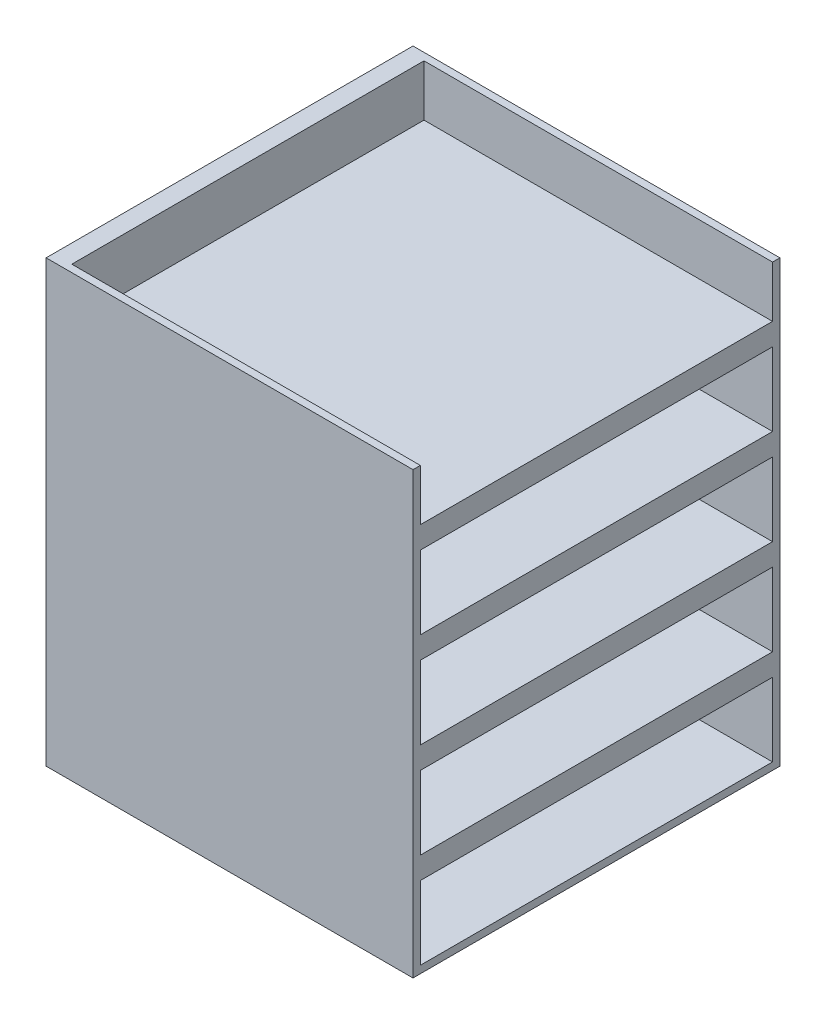
ISO-10303-21;
HEADER;
FILE_DESCRIPTION(('STEP AP214'),'2;1');
FILE_NAME('part.step','',(''),(''),'','','');
FILE_SCHEMA(('AUTOMOTIVE_DESIGN { 1 0 10303 214 1 1 1 1 }'));
ENDSEC;
DATA;
#1=APPLICATION_CONTEXT('core data for automotive mechanical design processes');
#2=APPLICATION_PROTOCOL_DEFINITION('international standard','automotive_design',2000,#1);
#3=PRODUCT_CONTEXT('',#1,'mechanical');
#4=PRODUCT('Part','Part','',(#3));
#5=PRODUCT_RELATED_PRODUCT_CATEGORY('part','',(#4));
#6=PRODUCT_DEFINITION_FORMATION('','',#4);
#7=PRODUCT_DEFINITION_CONTEXT('part definition',#1,'design');
#8=PRODUCT_DEFINITION('design','',#6,#7);
#9=PRODUCT_DEFINITION_SHAPE('','',#8);
#10=(LENGTH_UNIT() NAMED_UNIT(*) SI_UNIT(.MILLI.,.METRE.));
#11=(NAMED_UNIT(*) PLANE_ANGLE_UNIT() SI_UNIT($,.RADIAN.));
#12=(NAMED_UNIT(*) SI_UNIT($,.STERADIAN.) SOLID_ANGLE_UNIT());
#13=UNCERTAINTY_MEASURE_WITH_UNIT(LENGTH_MEASURE(1.E-05),#10,'distance_accuracy_value','');
#14=(GEOMETRIC_REPRESENTATION_CONTEXT(3) GLOBAL_UNCERTAINTY_ASSIGNED_CONTEXT((#13)) GLOBAL_UNIT_ASSIGNED_CONTEXT((#10,
#11,#12)) REPRESENTATION_CONTEXT('',''));
#15=CARTESIAN_POINT('',(0.,0.,0.));
#16=DIRECTION('',(0.,0.,1.));
#17=DIRECTION('',(1.,0.,0.));
#18=AXIS2_PLACEMENT_3D('',#15,#16,#17);
#19=CARTESIAN_POINT('',(250.,600.,-250.));
#20=DIRECTION('',(-1.,0.,0.));
#21=DIRECTION('',(0.,0.,1.));
#22=AXIS2_PLACEMENT_3D('',#19,#20,#21);
#23=PLANE('',#22);
#24=DIRECTION('',(0.,0.,-1.));
#25=VECTOR('',#24,1.);
#26=CARTESIAN_POINT('',(250.,140.,-239.999999999999));
#27=LINE('',#26,#25);
#28=CARTESIAN_POINT('',(250.,140.,240.));
#29=VERTEX_POINT('',#28);
#30=CARTESIAN_POINT('',(250.,140.,-239.999999999999));
#31=VERTEX_POINT('',#30);
#32=EDGE_CURVE('E223',#29,#31,#27,.T.);
#33=ORIENTED_EDGE('',*,*,#32,.F.);
#34=DIRECTION('',(0.,-1.,0.));
#35=VECTOR('',#34,1.);
#36=CARTESIAN_POINT('',(250.,240.,240.));
#37=LINE('',#36,#35);
#38=CARTESIAN_POINT('',(250.,240.,240.));
#39=VERTEX_POINT('',#38);
#40=EDGE_CURVE('E49',#39,#29,#37,.T.);
#41=ORIENTED_EDGE('',*,*,#40,.F.);
#42=DIRECTION('',(0.,0.,1.));
#43=VECTOR('',#42,1.);
#44=CARTESIAN_POINT('',(250.,240.,-239.999999999999));
#45=LINE('',#44,#43);
#46=CARTESIAN_POINT('',(250.,240.,-239.999999999999));
#47=VERTEX_POINT('',#46);
#48=EDGE_CURVE('E214',#47,#39,#45,.T.);
#49=ORIENTED_EDGE('',*,*,#48,.F.);
#50=DIRECTION('',(0.,1.,0.));
#51=VECTOR('',#50,1.);
#52=CARTESIAN_POINT('',(250.,240.,-239.999999999999));
#53=LINE('',#52,#51);
#54=EDGE_CURVE('E217',#31,#47,#53,.T.);
#55=ORIENTED_EDGE('',*,*,#54,.F.);
#56=EDGE_LOOP('',(#33,#41,#49,#55));
#57=FACE_BOUND('',#56,.T.);
#58=DIRECTION('',(0.,0.,-1.));
#59=VECTOR('',#58,1.);
#60=CARTESIAN_POINT('',(250.,270.,-239.999999999999));
#61=LINE('',#60,#59);
#62=CARTESIAN_POINT('',(250.,270.,240.000000000001));
#63=VERTEX_POINT('',#62);
#64=CARTESIAN_POINT('',(250.,270.,-239.999999999999));
#65=VERTEX_POINT('',#64);
#66=EDGE_CURVE('E249',#63,#65,#61,.T.);
#67=ORIENTED_EDGE('',*,*,#66,.F.);
#68=DIRECTION('',(0.,-1.,0.));
#69=VECTOR('',#68,1.);
#70=CARTESIAN_POINT('',(250.,370.,240.000000000001));
#71=LINE('',#70,#69);
#72=CARTESIAN_POINT('',(250.,370.,240.000000000001));
#73=VERTEX_POINT('',#72);
#74=EDGE_CURVE('E57',#73,#63,#71,.T.);
#75=ORIENTED_EDGE('',*,*,#74,.F.);
#76=DIRECTION('',(0.,0.,1.));
#77=VECTOR('',#76,1.);
#78=CARTESIAN_POINT('',(250.,370.,-239.999999999999));
#79=LINE('',#78,#77);
#80=CARTESIAN_POINT('',(250.,370.,-239.999999999999));
#81=VERTEX_POINT('',#80);
#82=EDGE_CURVE('E238',#81,#73,#79,.T.);
#83=ORIENTED_EDGE('',*,*,#82,.F.);
#84=DIRECTION('',(0.,1.,0.));
#85=VECTOR('',#84,1.);
#86=CARTESIAN_POINT('',(250.,370.,-239.999999999999));
#87=LINE('',#86,#85);
#88=EDGE_CURVE('E253',#65,#81,#87,.T.);
#89=ORIENTED_EDGE('',*,*,#88,.F.);
#90=EDGE_LOOP('',(#67,#75,#83,#89));
#91=FACE_BOUND('',#90,.T.);
#92=DIRECTION('',(0.,0.,-1.));
#93=VECTOR('',#92,1.);
#94=CARTESIAN_POINT('',(250.,400.,-239.999999999999));
#95=LINE('',#94,#93);
#96=CARTESIAN_POINT('',(250.,400.,240.000000000001));
#97=VERTEX_POINT('',#96);
#98=CARTESIAN_POINT('',(250.,400.,-239.999999999999));
#99=VERTEX_POINT('',#98);
#100=EDGE_CURVE('E280',#97,#99,#95,.T.);
#101=ORIENTED_EDGE('',*,*,#100,.F.);
#102=DIRECTION('',(0.,-1.,0.));
#103=VECTOR('',#102,1.);
#104=CARTESIAN_POINT('',(250.,500.,240.000000000001));
#105=LINE('',#104,#103);
#106=CARTESIAN_POINT('',(250.,500.,240.000000000001));
#107=VERTEX_POINT('',#106);
#108=EDGE_CURVE('E278',#107,#97,#105,.T.);
#109=ORIENTED_EDGE('',*,*,#108,.F.);
#110=DIRECTION('',(0.,0.,1.));
#111=VECTOR('',#110,1.);
#112=CARTESIAN_POINT('',(250.,500.,-239.999999999999));
#113=LINE('',#112,#111);
#114=CARTESIAN_POINT('',(250.,500.,-239.999999999999));
#115=VERTEX_POINT('',#114);
#116=EDGE_CURVE('E268',#115,#107,#113,.T.);
#117=ORIENTED_EDGE('',*,*,#116,.F.);
#118=DIRECTION('',(0.,1.,0.));
#119=VECTOR('',#118,1.);
#120=CARTESIAN_POINT('',(250.,500.,-239.999999999999));
#121=LINE('',#120,#119);
#122=EDGE_CURVE('E284',#99,#115,#121,.T.);
#123=ORIENTED_EDGE('',*,*,#122,.F.);
#124=EDGE_LOOP('',(#101,#109,#117,#123));
#125=FACE_BOUND('',#124,.T.);
#126=DIRECTION('',(0.,0.,-1.));
#127=VECTOR('',#126,1.);
#128=CARTESIAN_POINT('',(250.,10.,-240.));
#129=LINE('',#128,#127);
#130=CARTESIAN_POINT('',(250.,10.,240.));
#131=VERTEX_POINT('',#130);
#132=CARTESIAN_POINT('',(250.,10.,-240.));
#133=VERTEX_POINT('',#132);
#134=EDGE_CURVE('E329',#131,#133,#129,.T.);
#135=ORIENTED_EDGE('',*,*,#134,.F.);
#136=DIRECTION('',(0.,-1.,0.));
#137=VECTOR('',#136,1.);
#138=CARTESIAN_POINT('',(250.,110.,240.));
#139=LINE('',#138,#137);
#140=CARTESIAN_POINT('',(250.,110.,240.));
#141=VERTEX_POINT('',#140);
#142=EDGE_CURVE('E230',#141,#131,#139,.T.);
#143=ORIENTED_EDGE('',*,*,#142,.F.);
#144=DIRECTION('',(0.,0.,1.));
#145=VECTOR('',#144,1.);
#146=CARTESIAN_POINT('',(250.,110.,-240.));
#147=LINE('',#146,#145);
#148=CARTESIAN_POINT('',(250.,110.,-240.));
#149=VERTEX_POINT('',#148);
#150=EDGE_CURVE('E318',#149,#141,#147,.T.);
#151=ORIENTED_EDGE('',*,*,#150,.F.);
#152=DIRECTION('',(0.,1.,0.));
#153=VECTOR('',#152,1.);
#154=CARTESIAN_POINT('',(250.,110.,-240.));
#155=LINE('',#154,#153);
#156=EDGE_CURVE('E332',#133,#149,#155,.T.);
#157=ORIENTED_EDGE('',*,*,#156,.F.);
#158=EDGE_LOOP('',(#135,#143,#151,#157));
#159=FACE_BOUND('',#158,.T.);
#160=DIRECTION('',(0.,0.,-1.));
#161=VECTOR('',#160,1.);
#162=CARTESIAN_POINT('',(250.,530.,-239.999999999998));
#163=LINE('',#162,#161);
#164=CARTESIAN_POINT('',(250.,530.,240.000000000002));
#165=VERTEX_POINT('',#164);
#166=CARTESIAN_POINT('',(250.,530.,-239.999999999998));
#167=VERTEX_POINT('',#166);
#168=EDGE_CURVE('E307',#165,#167,#163,.T.);
#169=ORIENTED_EDGE('',*,*,#168,.F.);
#170=DIRECTION('',(0.,-1.,0.));
#171=VECTOR('',#170,1.);
#172=CARTESIAN_POINT('',(250.,630.,240.000000000002));
#173=LINE('',#172,#171);
#174=CARTESIAN_POINT('',(250.,600.,240.000000000002));
#175=VERTEX_POINT('',#174);
#176=EDGE_CURVE('E305',#175,#165,#173,.T.);
#177=ORIENTED_EDGE('',*,*,#176,.F.);
#178=DIRECTION('',(0.,0.,-1.));
#179=VECTOR('',#178,1.);
#180=CARTESIAN_POINT('',(250.,600.,-250.));
#181=LINE('',#180,#179);
#182=CARTESIAN_POINT('',(250.,600.,250.));
#183=VERTEX_POINT('',#182);
#184=EDGE_CURVE('E346',#183,#175,#181,.T.);
#185=ORIENTED_EDGE('',*,*,#184,.F.);
#186=DIRECTION('',(0.,-1.,0.));
#187=VECTOR('',#186,1.);
#188=CARTESIAN_POINT('',(250.,600.,250.));
#189=LINE('',#188,#187);
#190=CARTESIAN_POINT('',(250.,0.,250.));
#191=VERTEX_POINT('',#190);
#192=EDGE_CURVE('E356',#183,#191,#189,.T.);
#193=ORIENTED_EDGE('',*,*,#192,.T.);
#194=DIRECTION('',(0.,0.,-1.));
#195=VECTOR('',#194,1.);
#196=CARTESIAN_POINT('',(250.,0.,-250.));
#197=LINE('',#196,#195);
#198=CARTESIAN_POINT('',(250.,0.,-250.));
#199=VERTEX_POINT('',#198);
#200=EDGE_CURVE('E339',#191,#199,#197,.T.);
#201=ORIENTED_EDGE('',*,*,#200,.T.);
#202=DIRECTION('',(0.,-1.,0.));
#203=VECTOR('',#202,1.);
#204=CARTESIAN_POINT('',(250.,600.,-250.));
#205=LINE('',#204,#203);
#206=CARTESIAN_POINT('',(250.,600.,-250.));
#207=VERTEX_POINT('',#206);
#208=EDGE_CURVE('E373',#207,#199,#205,.T.);
#209=ORIENTED_EDGE('',*,*,#208,.F.);
#210=CARTESIAN_POINT('',(250.,600.,-239.999999999998));
#211=VERTEX_POINT('',#210);
#212=EDGE_CURVE('E350',#211,#207,#181,.T.);
#213=ORIENTED_EDGE('',*,*,#212,.F.);
#214=DIRECTION('',(0.,1.,0.));
#215=VECTOR('',#214,1.);
#216=CARTESIAN_POINT('',(250.,630.,-239.999999999998));
#217=LINE('',#216,#215);
#218=EDGE_CURVE('E299',#167,#211,#217,.T.);
#219=ORIENTED_EDGE('',*,*,#218,.F.);
#220=EDGE_LOOP('',(#169,#177,#185,#193,#201,#209,#213,#219));
#221=FACE_BOUND('',#220,.T.);
#222=ADVANCED_FACE('F35',(#57,#91,#125,#159,#221),#23,.F.);
#223=CARTESIAN_POINT('',(-250.,600.,-250.));
#224=DIRECTION('',(0.,0.,1.));
#225=DIRECTION('',(1.,0.,0.));
#226=AXIS2_PLACEMENT_3D('',#223,#224,#225);
#227=PLANE('',#226);
#228=DIRECTION('',(-1.,0.,0.));
#229=VECTOR('',#228,1.);
#230=CARTESIAN_POINT('',(-250.,0.,-250.));
#231=LINE('',#230,#229);
#232=CARTESIAN_POINT('',(-250.,0.,-250.));
#233=VERTEX_POINT('',#232);
#234=EDGE_CURVE('E359',#199,#233,#231,.T.);
#235=ORIENTED_EDGE('',*,*,#234,.T.);
#236=DIRECTION('',(0.,-1.,0.));
#237=VECTOR('',#236,1.);
#238=CARTESIAN_POINT('',(-250.,600.,-250.));
#239=LINE('',#238,#237);
#240=CARTESIAN_POINT('',(-250.,600.,-250.));
#241=VERTEX_POINT('',#240);
#242=EDGE_CURVE('E370',#241,#233,#239,.T.);
#243=ORIENTED_EDGE('',*,*,#242,.F.);
#244=DIRECTION('',(-1.,0.,0.));
#245=VECTOR('',#244,1.);
#246=CARTESIAN_POINT('',(-250.,600.,-250.));
#247=LINE('',#246,#245);
#248=EDGE_CURVE('E349',#207,#241,#247,.T.);
#249=ORIENTED_EDGE('',*,*,#248,.F.);
#250=ORIENTED_EDGE('',*,*,#208,.T.);
#251=EDGE_LOOP('',(#235,#243,#249,#250));
#252=FACE_BOUND('',#251,.T.);
#253=ADVANCED_FACE('F404',(#252),#227,.F.);
#254=CARTESIAN_POINT('',(-250.,600.,-250.));
#255=DIRECTION('',(1.,0.,0.));
#256=DIRECTION('',(0.,0.,-1.));
#257=AXIS2_PLACEMENT_3D('',#254,#255,#256);
#258=PLANE('',#257);
#259=DIRECTION('',(0.,0.,1.));
#260=VECTOR('',#259,1.);
#261=CARTESIAN_POINT('',(-250.,0.,-250.));
#262=LINE('',#261,#260);
#263=CARTESIAN_POINT('',(-250.,0.,250.));
#264=VERTEX_POINT('',#263);
#265=EDGE_CURVE('E361',#233,#264,#262,.T.);
#266=ORIENTED_EDGE('',*,*,#265,.T.);
#267=DIRECTION('',(0.,-1.,0.));
#268=VECTOR('',#267,1.);
#269=CARTESIAN_POINT('',(-250.,600.,250.));
#270=LINE('',#269,#268);
#271=CARTESIAN_POINT('',(-250.,600.,250.));
#272=VERTEX_POINT('',#271);
#273=EDGE_CURVE('E367',#272,#264,#270,.T.);
#274=ORIENTED_EDGE('',*,*,#273,.F.);
#275=DIRECTION('',(0.,0.,1.));
#276=VECTOR('',#275,1.);
#277=CARTESIAN_POINT('',(-250.,600.,-250.));
#278=LINE('',#277,#276);
#279=EDGE_CURVE('E352',#241,#272,#278,.T.);
#280=ORIENTED_EDGE('',*,*,#279,.F.);
#281=ORIENTED_EDGE('',*,*,#242,.T.);
#282=EDGE_LOOP('',(#266,#274,#280,#281));
#283=FACE_BOUND('',#282,.T.);
#284=ADVANCED_FACE('F409',(#283),#258,.F.);
#285=CARTESIAN_POINT('',(-250.,600.,250.));
#286=DIRECTION('',(0.,0.,-1.));
#287=DIRECTION('',(-1.,0.,0.));
#288=AXIS2_PLACEMENT_3D('',#285,#286,#287);
#289=PLANE('',#288);
#290=DIRECTION('',(1.,0.,0.));
#291=VECTOR('',#290,1.);
#292=CARTESIAN_POINT('',(-250.,0.,250.));
#293=LINE('',#292,#291);
#294=EDGE_CURVE('E363',#264,#191,#293,.T.);
#295=ORIENTED_EDGE('',*,*,#294,.T.);
#296=ORIENTED_EDGE('',*,*,#192,.F.);
#297=DIRECTION('',(1.,0.,0.));
#298=VECTOR('',#297,1.);
#299=CARTESIAN_POINT('',(-250.,600.,250.));
#300=LINE('',#299,#298);
#301=EDGE_CURVE('E354',#272,#183,#300,.T.);
#302=ORIENTED_EDGE('',*,*,#301,.F.);
#303=ORIENTED_EDGE('',*,*,#273,.T.);
#304=EDGE_LOOP('',(#295,#296,#302,#303));
#305=FACE_BOUND('',#304,.T.);
#306=ADVANCED_FACE('F414',(#305),#289,.F.);
#307=CARTESIAN_POINT('',(0.,600.,0.));
#308=DIRECTION('',(0.,1.,0.));
#309=DIRECTION('',(0.,0.,1.));
#310=AXIS2_PLACEMENT_3D('',#307,#308,#309);
#311=PLANE('',#310);
#312=DIRECTION('',(1.,0.,0.));
#313=VECTOR('',#312,1.);
#314=CARTESIAN_POINT('',(0.,600.,240.000000000002));
#315=LINE('',#314,#313);
#316=CARTESIAN_POINT('',(-225.,600.,240.000000000002));
#317=VERTEX_POINT('',#316);
#318=EDGE_CURVE('E11',#317,#175,#315,.T.);
#319=ORIENTED_EDGE('',*,*,#318,.F.);
#320=DIRECTION('',(0.,0.,1.));
#321=VECTOR('',#320,1.);
#322=CARTESIAN_POINT('',(-225.,600.,0.));
#323=LINE('',#322,#321);
#324=CARTESIAN_POINT('',(-225.,600.,-239.999999999998));
#325=VERTEX_POINT('',#324);
#326=EDGE_CURVE('E376',#325,#317,#323,.T.);
#327=ORIENTED_EDGE('',*,*,#326,.F.);
#328=DIRECTION('',(-1.,0.,0.));
#329=VECTOR('',#328,1.);
#330=CARTESIAN_POINT('',(0.,600.,-239.999999999998));
#331=LINE('',#330,#329);
#332=EDGE_CURVE('E42',#211,#325,#331,.T.);
#333=ORIENTED_EDGE('',*,*,#332,.F.);
#334=ORIENTED_EDGE('',*,*,#212,.T.);
#335=ORIENTED_EDGE('',*,*,#248,.T.);
#336=ORIENTED_EDGE('',*,*,#279,.T.);
#337=ORIENTED_EDGE('',*,*,#301,.T.);
#338=ORIENTED_EDGE('',*,*,#184,.T.);
#339=EDGE_LOOP('',(#319,#327,#333,#334,#335,#336,#337,#338));
#340=FACE_BOUND('',#339,.T.);
#341=ADVANCED_FACE('F387',(#340),#311,.T.);
#342=CARTESIAN_POINT('',(0.,0.,0.));
#343=DIRECTION('',(0.,1.,0.));
#344=DIRECTION('',(0.,0.,1.));
#345=AXIS2_PLACEMENT_3D('',#342,#343,#344);
#346=PLANE('',#345);
#347=ORIENTED_EDGE('',*,*,#200,.F.);
#348=ORIENTED_EDGE('',*,*,#294,.F.);
#349=ORIENTED_EDGE('',*,*,#265,.F.);
#350=ORIENTED_EDGE('',*,*,#234,.F.);
#351=EDGE_LOOP('',(#347,#348,#349,#350));
#352=FACE_BOUND('',#351,.T.);
#353=ADVANCED_FACE('F418',(#352),#346,.F.);
#354=CARTESIAN_POINT('',(-225.,110.,240.));
#355=DIRECTION('',(0.,0.,1.));
#356=DIRECTION('',(1.,0.,0.));
#357=AXIS2_PLACEMENT_3D('',#354,#355,#356);
#358=PLANE('',#357);
#359=ORIENTED_EDGE('',*,*,#142,.T.);
#360=DIRECTION('',(1.,0.,0.));
#361=VECTOR('',#360,1.);
#362=CARTESIAN_POINT('',(-225.,10.,240.));
#363=LINE('',#362,#361);
#364=CARTESIAN_POINT('',(-225.,10.,240.));
#365=VERTEX_POINT('',#364);
#366=EDGE_CURVE('E327',#365,#131,#363,.T.);
#367=ORIENTED_EDGE('',*,*,#366,.F.);
#368=DIRECTION('',(0.,-1.,0.));
#369=VECTOR('',#368,1.);
#370=CARTESIAN_POINT('',(-225.,110.,240.));
#371=LINE('',#370,#369);
#372=CARTESIAN_POINT('',(-225.,110.,240.));
#373=VERTEX_POINT('',#372);
#374=EDGE_CURVE('E314',#373,#365,#371,.T.);
#375=ORIENTED_EDGE('',*,*,#374,.F.);
#376=DIRECTION('',(1.,0.,0.));
#377=VECTOR('',#376,1.);
#378=CARTESIAN_POINT('',(-225.,110.,240.));
#379=LINE('',#378,#377);
#380=EDGE_CURVE('E337',#373,#141,#379,.T.);
#381=ORIENTED_EDGE('',*,*,#380,.T.);
#382=EDGE_LOOP('',(#359,#367,#375,#381));
#383=FACE_BOUND('',#382,.T.);
#384=ADVANCED_FACE('F420',(#383),#358,.F.);
#385=CARTESIAN_POINT('',(-225.,110.,-240.));
#386=DIRECTION('',(0.,1.,0.));
#387=DIRECTION('',(0.,0.,1.));
#388=AXIS2_PLACEMENT_3D('',#385,#386,#387);
#389=PLANE('',#388);
#390=ORIENTED_EDGE('',*,*,#150,.T.);
#391=ORIENTED_EDGE('',*,*,#380,.F.);
#392=DIRECTION('',(0.,0.,1.));
#393=VECTOR('',#392,1.);
#394=CARTESIAN_POINT('',(-225.,110.,-240.));
#395=LINE('',#394,#393);
#396=CARTESIAN_POINT('',(-225.,110.,-240.));
#397=VERTEX_POINT('',#396);
#398=EDGE_CURVE('E324',#397,#373,#395,.T.);
#399=ORIENTED_EDGE('',*,*,#398,.F.);
#400=DIRECTION('',(1.,0.,0.));
#401=VECTOR('',#400,1.);
#402=CARTESIAN_POINT('',(-225.,110.,-240.));
#403=LINE('',#402,#401);
#404=EDGE_CURVE('E340',#397,#149,#403,.T.);
#405=ORIENTED_EDGE('',*,*,#404,.T.);
#406=EDGE_LOOP('',(#390,#391,#399,#405));
#407=FACE_BOUND('',#406,.T.);
#408=ADVANCED_FACE('F426',(#407),#389,.F.);
#409=CARTESIAN_POINT('',(-225.,110.,-240.));
#410=DIRECTION('',(0.,0.,-1.));
#411=DIRECTION('',(-1.,0.,0.));
#412=AXIS2_PLACEMENT_3D('',#409,#410,#411);
#413=PLANE('',#412);
#414=ORIENTED_EDGE('',*,*,#156,.T.);
#415=ORIENTED_EDGE('',*,*,#404,.F.);
#416=DIRECTION('',(0.,1.,0.));
#417=VECTOR('',#416,1.);
#418=CARTESIAN_POINT('',(-225.,110.,-240.));
#419=LINE('',#418,#417);
#420=CARTESIAN_POINT('',(-225.,10.,-240.));
#421=VERTEX_POINT('',#420);
#422=EDGE_CURVE('E321',#421,#397,#419,.T.);
#423=ORIENTED_EDGE('',*,*,#422,.F.);
#424=DIRECTION('',(1.,0.,0.));
#425=VECTOR('',#424,1.);
#426=CARTESIAN_POINT('',(-225.,10.,-240.));
#427=LINE('',#426,#425);
#428=EDGE_CURVE('E342',#421,#133,#427,.T.);
#429=ORIENTED_EDGE('',*,*,#428,.T.);
#430=EDGE_LOOP('',(#414,#415,#423,#429));
#431=FACE_BOUND('',#430,.T.);
#432=ADVANCED_FACE('F457',(#431),#413,.F.);
#433=CARTESIAN_POINT('',(-225.,10.,-240.));
#434=DIRECTION('',(0.,-1.,0.));
#435=DIRECTION('',(0.,0.,-1.));
#436=AXIS2_PLACEMENT_3D('',#433,#434,#435);
#437=PLANE('',#436);
#438=ORIENTED_EDGE('',*,*,#134,.T.);
#439=ORIENTED_EDGE('',*,*,#428,.F.);
#440=DIRECTION('',(0.,0.,-1.));
#441=VECTOR('',#440,1.);
#442=CARTESIAN_POINT('',(-225.,10.,-240.));
#443=LINE('',#442,#441);
#444=EDGE_CURVE('E317',#365,#421,#443,.T.);
#445=ORIENTED_EDGE('',*,*,#444,.F.);
#446=ORIENTED_EDGE('',*,*,#366,.T.);
#447=EDGE_LOOP('',(#438,#439,#445,#446));
#448=FACE_BOUND('',#447,.T.);
#449=ADVANCED_FACE('F450',(#448),#437,.F.);
#450=CARTESIAN_POINT('',(-225.,0.,0.));
#451=DIRECTION('',(-1.,0.,0.));
#452=DIRECTION('',(0.,0.,1.));
#453=AXIS2_PLACEMENT_3D('',#450,#451,#452);
#454=PLANE('',#453);
#455=ORIENTED_EDGE('',*,*,#374,.T.);
#456=ORIENTED_EDGE('',*,*,#444,.T.);
#457=ORIENTED_EDGE('',*,*,#422,.T.);
#458=ORIENTED_EDGE('',*,*,#398,.T.);
#459=EDGE_LOOP('',(#455,#456,#457,#458));
#460=FACE_BOUND('',#459,.T.);
#461=ADVANCED_FACE('F459',(#460),#454,.F.);
#462=CARTESIAN_POINT('',(-225.,630.,240.000000000002));
#463=DIRECTION('',(0.,0.,1.));
#464=DIRECTION('',(1.,0.,0.));
#465=AXIS2_PLACEMENT_3D('',#462,#463,#464);
#466=PLANE('',#465);
#467=ORIENTED_EDGE('',*,*,#318,.T.);
#468=ORIENTED_EDGE('',*,*,#176,.T.);
#469=DIRECTION('',(1.,0.,0.));
#470=VECTOR('',#469,1.);
#471=CARTESIAN_POINT('',(-225.,530.,240.000000000002));
#472=LINE('',#471,#470);
#473=CARTESIAN_POINT('',(-225.,530.,240.000000000002));
#474=VERTEX_POINT('',#473);
#475=EDGE_CURVE('E304',#474,#165,#472,.T.);
#476=ORIENTED_EDGE('',*,*,#475,.F.);
#477=DIRECTION('',(0.,-1.,0.));
#478=VECTOR('',#477,1.);
#479=CARTESIAN_POINT('',(-225.,630.,240.000000000002));
#480=LINE('',#479,#478);
#481=EDGE_CURVE('E296',#317,#474,#480,.T.);
#482=ORIENTED_EDGE('',*,*,#481,.F.);
#483=EDGE_LOOP('',(#467,#468,#476,#482));
#484=FACE_BOUND('',#483,.T.);
#485=ADVANCED_FACE('F393',(#484),#466,.F.);
#486=CARTESIAN_POINT('',(-225.,630.,-239.999999999998));
#487=DIRECTION('',(0.,0.,-1.));
#488=DIRECTION('',(-1.,0.,0.));
#489=AXIS2_PLACEMENT_3D('',#486,#487,#488);
#490=PLANE('',#489);
#491=ORIENTED_EDGE('',*,*,#332,.T.);
#492=DIRECTION('',(0.,1.,0.));
#493=VECTOR('',#492,1.);
#494=CARTESIAN_POINT('',(-225.,630.,-239.999999999998));
#495=LINE('',#494,#493);
#496=CARTESIAN_POINT('',(-225.,530.,-239.999999999998));
#497=VERTEX_POINT('',#496);
#498=EDGE_CURVE('E302',#497,#325,#495,.T.);
#499=ORIENTED_EDGE('',*,*,#498,.F.);
#500=DIRECTION('',(1.,0.,0.));
#501=VECTOR('',#500,1.);
#502=CARTESIAN_POINT('',(-225.,530.,-239.999999999998));
#503=LINE('',#502,#501);
#504=EDGE_CURVE('E281',#497,#167,#503,.T.);
#505=ORIENTED_EDGE('',*,*,#504,.T.);
#506=ORIENTED_EDGE('',*,*,#218,.T.);
#507=EDGE_LOOP('',(#491,#499,#505,#506));
#508=FACE_BOUND('',#507,.T.);
#509=ADVANCED_FACE('F382',(#508),#490,.F.);
#510=CARTESIAN_POINT('',(-225.,530.,-239.999999999998));
#511=DIRECTION('',(0.,-1.,0.));
#512=DIRECTION('',(0.,0.,-1.));
#513=AXIS2_PLACEMENT_3D('',#510,#511,#512);
#514=PLANE('',#513);
#515=ORIENTED_EDGE('',*,*,#168,.T.);
#516=ORIENTED_EDGE('',*,*,#504,.F.);
#517=DIRECTION('',(0.,0.,-1.));
#518=VECTOR('',#517,1.);
#519=CARTESIAN_POINT('',(-225.,530.,-239.999999999998));
#520=LINE('',#519,#518);
#521=EDGE_CURVE('E298',#474,#497,#520,.T.);
#522=ORIENTED_EDGE('',*,*,#521,.F.);
#523=ORIENTED_EDGE('',*,*,#475,.T.);
#524=EDGE_LOOP('',(#515,#516,#522,#523));
#525=FACE_BOUND('',#524,.T.);
#526=ADVANCED_FACE('F398',(#525),#514,.F.);
#527=CARTESIAN_POINT('',(-225.,0.,0.));
#528=DIRECTION('',(-1.,0.,0.));
#529=DIRECTION('',(0.,0.,1.));
#530=AXIS2_PLACEMENT_3D('',#527,#528,#529);
#531=PLANE('',#530);
#532=ORIENTED_EDGE('',*,*,#326,.T.);
#533=ORIENTED_EDGE('',*,*,#481,.T.);
#534=ORIENTED_EDGE('',*,*,#521,.T.);
#535=ORIENTED_EDGE('',*,*,#498,.T.);
#536=EDGE_LOOP('',(#532,#533,#534,#535));
#537=FACE_BOUND('',#536,.T.);
#538=ADVANCED_FACE('F390',(#537),#531,.F.);
#539=CARTESIAN_POINT('',(-225.,500.,240.000000000001));
#540=DIRECTION('',(0.,0.,1.));
#541=DIRECTION('',(1.,0.,0.));
#542=AXIS2_PLACEMENT_3D('',#539,#540,#541);
#543=PLANE('',#542);
#544=ORIENTED_EDGE('',*,*,#108,.T.);
#545=DIRECTION('',(1.,0.,0.));
#546=VECTOR('',#545,1.);
#547=CARTESIAN_POINT('',(-225.,400.,240.000000000001));
#548=LINE('',#547,#546);
#549=CARTESIAN_POINT('',(-225.,400.,240.000000000001));
#550=VERTEX_POINT('',#549);
#551=EDGE_CURVE('E277',#550,#97,#548,.T.);
#552=ORIENTED_EDGE('',*,*,#551,.F.);
#553=DIRECTION('',(0.,-1.,0.));
#554=VECTOR('',#553,1.);
#555=CARTESIAN_POINT('',(-225.,500.,240.000000000001));
#556=LINE('',#555,#554);
#557=CARTESIAN_POINT('',(-225.,500.,240.000000000001));
#558=VERTEX_POINT('',#557);
#559=EDGE_CURVE('E264',#558,#550,#556,.T.);
#560=ORIENTED_EDGE('',*,*,#559,.F.);
#561=DIRECTION('',(1.,0.,0.));
#562=VECTOR('',#561,1.);
#563=CARTESIAN_POINT('',(-225.,500.,240.000000000001));
#564=LINE('',#563,#562);
#565=EDGE_CURVE('E250',#558,#107,#564,.T.);
#566=ORIENTED_EDGE('',*,*,#565,.T.);
#567=EDGE_LOOP('',(#544,#552,#560,#566));
#568=FACE_BOUND('',#567,.T.);
#569=ADVANCED_FACE('F515',(#568),#543,.F.);
#570=CARTESIAN_POINT('',(-225.,500.,-239.999999999999));
#571=DIRECTION('',(0.,1.,0.));
#572=DIRECTION('',(0.,0.,1.));
#573=AXIS2_PLACEMENT_3D('',#570,#571,#572);
#574=PLANE('',#573);
#575=ORIENTED_EDGE('',*,*,#116,.T.);
#576=ORIENTED_EDGE('',*,*,#565,.F.);
#577=DIRECTION('',(0.,0.,1.));
#578=VECTOR('',#577,1.);
#579=CARTESIAN_POINT('',(-225.,500.,-239.999999999999));
#580=LINE('',#579,#578);
#581=CARTESIAN_POINT('',(-225.,500.,-239.999999999999));
#582=VERTEX_POINT('',#581);
#583=EDGE_CURVE('E274',#582,#558,#580,.T.);
#584=ORIENTED_EDGE('',*,*,#583,.F.);
#585=DIRECTION('',(1.,0.,0.));
#586=VECTOR('',#585,1.);
#587=CARTESIAN_POINT('',(-225.,500.,-239.999999999999));
#588=LINE('',#587,#586);
#589=EDGE_CURVE('E290',#582,#115,#588,.T.);
#590=ORIENTED_EDGE('',*,*,#589,.T.);
#591=EDGE_LOOP('',(#575,#576,#584,#590));
#592=FACE_BOUND('',#591,.T.);
#593=ADVANCED_FACE('F524',(#592),#574,.F.);
#594=CARTESIAN_POINT('',(-225.,500.,-239.999999999999));
#595=DIRECTION('',(0.,0.,-1.));
#596=DIRECTION('',(-1.,0.,0.));
#597=AXIS2_PLACEMENT_3D('',#594,#595,#596);
#598=PLANE('',#597);
#599=ORIENTED_EDGE('',*,*,#122,.T.);
#600=ORIENTED_EDGE('',*,*,#589,.F.);
#601=DIRECTION('',(0.,1.,0.));
#602=VECTOR('',#601,1.);
#603=CARTESIAN_POINT('',(-225.,500.,-239.999999999999));
#604=LINE('',#603,#602);
#605=CARTESIAN_POINT('',(-225.,400.,-239.999999999999));
#606=VERTEX_POINT('',#605);
#607=EDGE_CURVE('E271',#606,#582,#604,.T.);
#608=ORIENTED_EDGE('',*,*,#607,.F.);
#609=DIRECTION('',(1.,0.,0.));
#610=VECTOR('',#609,1.);
#611=CARTESIAN_POINT('',(-225.,400.,-239.999999999999));
#612=LINE('',#611,#610);
#613=EDGE_CURVE('E292',#606,#99,#612,.T.);
#614=ORIENTED_EDGE('',*,*,#613,.T.);
#615=EDGE_LOOP('',(#599,#600,#608,#614));
#616=FACE_BOUND('',#615,.T.);
#617=ADVANCED_FACE('F534',(#616),#598,.F.);
#618=CARTESIAN_POINT('',(-225.,400.,-239.999999999999));
#619=DIRECTION('',(0.,-1.,0.));
#620=DIRECTION('',(0.,0.,-1.));
#621=AXIS2_PLACEMENT_3D('',#618,#619,#620);
#622=PLANE('',#621);
#623=ORIENTED_EDGE('',*,*,#100,.T.);
#624=ORIENTED_EDGE('',*,*,#613,.F.);
#625=DIRECTION('',(0.,0.,-1.));
#626=VECTOR('',#625,1.);
#627=CARTESIAN_POINT('',(-225.,400.,-239.999999999999));
#628=LINE('',#627,#626);
#629=EDGE_CURVE('E267',#550,#606,#628,.T.);
#630=ORIENTED_EDGE('',*,*,#629,.F.);
#631=ORIENTED_EDGE('',*,*,#551,.T.);
#632=EDGE_LOOP('',(#623,#624,#630,#631));
#633=FACE_BOUND('',#632,.T.);
#634=ADVANCED_FACE('F544',(#633),#622,.F.);
#635=CARTESIAN_POINT('',(-225.,0.,0.));
#636=DIRECTION('',(-1.,0.,0.));
#637=DIRECTION('',(0.,0.,1.));
#638=AXIS2_PLACEMENT_3D('',#635,#636,#637);
#639=PLANE('',#638);
#640=ORIENTED_EDGE('',*,*,#559,.T.);
#641=ORIENTED_EDGE('',*,*,#629,.T.);
#642=ORIENTED_EDGE('',*,*,#607,.T.);
#643=ORIENTED_EDGE('',*,*,#583,.T.);
#644=EDGE_LOOP('',(#640,#641,#642,#643));
#645=FACE_BOUND('',#644,.T.);
#646=ADVANCED_FACE('F554',(#645),#639,.F.);
#647=CARTESIAN_POINT('',(-225.,370.,240.000000000001));
#648=DIRECTION('',(0.,0.,1.));
#649=DIRECTION('',(1.,0.,0.));
#650=AXIS2_PLACEMENT_3D('',#647,#648,#649);
#651=PLANE('',#650);
#652=ORIENTED_EDGE('',*,*,#74,.T.);
#653=DIRECTION('',(1.,0.,0.));
#654=VECTOR('',#653,1.);
#655=CARTESIAN_POINT('',(-225.,270.,240.000000000001));
#656=LINE('',#655,#654);
#657=CARTESIAN_POINT('',(-225.,270.,240.000000000001));
#658=VERTEX_POINT('',#657);
#659=EDGE_CURVE('E247',#658,#63,#656,.T.);
#660=ORIENTED_EDGE('',*,*,#659,.F.);
#661=DIRECTION('',(0.,-1.,0.));
#662=VECTOR('',#661,1.);
#663=CARTESIAN_POINT('',(-225.,370.,240.000000000001));
#664=LINE('',#663,#662);
#665=CARTESIAN_POINT('',(-225.,370.,240.000000000001));
#666=VERTEX_POINT('',#665);
#667=EDGE_CURVE('E234',#666,#658,#664,.T.);
#668=ORIENTED_EDGE('',*,*,#667,.F.);
#669=DIRECTION('',(1.,0.,0.));
#670=VECTOR('',#669,1.);
#671=CARTESIAN_POINT('',(-225.,370.,240.000000000001));
#672=LINE('',#671,#670);
#673=EDGE_CURVE('E224',#666,#73,#672,.T.);
#674=ORIENTED_EDGE('',*,*,#673,.T.);
#675=EDGE_LOOP('',(#652,#660,#668,#674));
#676=FACE_BOUND('',#675,.T.);
#677=ADVANCED_FACE('F564',(#676),#651,.F.);
#678=CARTESIAN_POINT('',(-225.,370.,-239.999999999999));
#679=DIRECTION('',(0.,1.,0.));
#680=DIRECTION('',(0.,0.,1.));
#681=AXIS2_PLACEMENT_3D('',#678,#679,#680);
#682=PLANE('',#681);
#683=ORIENTED_EDGE('',*,*,#82,.T.);
#684=ORIENTED_EDGE('',*,*,#673,.F.);
#685=DIRECTION('',(0.,0.,1.));
#686=VECTOR('',#685,1.);
#687=CARTESIAN_POINT('',(-225.,370.,-239.999999999999));
#688=LINE('',#687,#686);
#689=CARTESIAN_POINT('',(-225.,370.,-239.999999999999));
#690=VERTEX_POINT('',#689);
#691=EDGE_CURVE('E244',#690,#666,#688,.T.);
#692=ORIENTED_EDGE('',*,*,#691,.F.);
#693=DIRECTION('',(1.,0.,0.));
#694=VECTOR('',#693,1.);
#695=CARTESIAN_POINT('',(-225.,370.,-239.999999999999));
#696=LINE('',#695,#694);
#697=EDGE_CURVE('E259',#690,#81,#696,.T.);
#698=ORIENTED_EDGE('',*,*,#697,.T.);
#699=EDGE_LOOP('',(#683,#684,#692,#698));
#700=FACE_BOUND('',#699,.T.);
#701=ADVANCED_FACE('F574',(#700),#682,.F.);
#702=CARTESIAN_POINT('',(-225.,370.,-239.999999999999));
#703=DIRECTION('',(0.,0.,-1.));
#704=DIRECTION('',(-1.,0.,0.));
#705=AXIS2_PLACEMENT_3D('',#702,#703,#704);
#706=PLANE('',#705);
#707=ORIENTED_EDGE('',*,*,#88,.T.);
#708=ORIENTED_EDGE('',*,*,#697,.F.);
#709=DIRECTION('',(0.,1.,0.));
#710=VECTOR('',#709,1.);
#711=CARTESIAN_POINT('',(-225.,370.,-239.999999999999));
#712=LINE('',#711,#710);
#713=CARTESIAN_POINT('',(-225.,270.,-239.999999999999));
#714=VERTEX_POINT('',#713);
#715=EDGE_CURVE('E241',#714,#690,#712,.T.);
#716=ORIENTED_EDGE('',*,*,#715,.F.);
#717=DIRECTION('',(1.,0.,0.));
#718=VECTOR('',#717,1.);
#719=CARTESIAN_POINT('',(-225.,270.,-239.999999999999));
#720=LINE('',#719,#718);
#721=EDGE_CURVE('E261',#714,#65,#720,.T.);
#722=ORIENTED_EDGE('',*,*,#721,.T.);
#723=EDGE_LOOP('',(#707,#708,#716,#722));
#724=FACE_BOUND('',#723,.T.);
#725=ADVANCED_FACE('F583',(#724),#706,.F.);
#726=CARTESIAN_POINT('',(-225.,270.,-239.999999999999));
#727=DIRECTION('',(0.,-1.,0.));
#728=DIRECTION('',(0.,0.,-1.));
#729=AXIS2_PLACEMENT_3D('',#726,#727,#728);
#730=PLANE('',#729);
#731=ORIENTED_EDGE('',*,*,#66,.T.);
#732=ORIENTED_EDGE('',*,*,#721,.F.);
#733=DIRECTION('',(0.,0.,-1.));
#734=VECTOR('',#733,1.);
#735=CARTESIAN_POINT('',(-225.,270.,-239.999999999999));
#736=LINE('',#735,#734);
#737=EDGE_CURVE('E237',#658,#714,#736,.T.);
#738=ORIENTED_EDGE('',*,*,#737,.F.);
#739=ORIENTED_EDGE('',*,*,#659,.T.);
#740=EDGE_LOOP('',(#731,#732,#738,#739));
#741=FACE_BOUND('',#740,.T.);
#742=ADVANCED_FACE('F593',(#741),#730,.F.);
#743=CARTESIAN_POINT('',(-225.,0.,0.));
#744=DIRECTION('',(-1.,0.,0.));
#745=DIRECTION('',(0.,0.,1.));
#746=AXIS2_PLACEMENT_3D('',#743,#744,#745);
#747=PLANE('',#746);
#748=ORIENTED_EDGE('',*,*,#667,.T.);
#749=ORIENTED_EDGE('',*,*,#737,.T.);
#750=ORIENTED_EDGE('',*,*,#715,.T.);
#751=ORIENTED_EDGE('',*,*,#691,.T.);
#752=EDGE_LOOP('',(#748,#749,#750,#751));
#753=FACE_BOUND('',#752,.T.);
#754=ADVANCED_FACE('F603',(#753),#747,.F.);
#755=CARTESIAN_POINT('',(-225.,240.,240.));
#756=DIRECTION('',(0.,0.,1.));
#757=DIRECTION('',(1.,0.,0.));
#758=AXIS2_PLACEMENT_3D('',#755,#756,#757);
#759=PLANE('',#758);
#760=ORIENTED_EDGE('',*,*,#40,.T.);
#761=DIRECTION('',(1.,0.,0.));
#762=VECTOR('',#761,1.);
#763=CARTESIAN_POINT('',(-225.,140.,240.));
#764=LINE('',#763,#762);
#765=CARTESIAN_POINT('',(-225.,140.,240.));
#766=VERTEX_POINT('',#765);
#767=EDGE_CURVE('E192',#766,#29,#764,.T.);
#768=ORIENTED_EDGE('',*,*,#767,.F.);
#769=DIRECTION('',(0.,-1.,0.));
#770=VECTOR('',#769,1.);
#771=CARTESIAN_POINT('',(-225.,240.,240.));
#772=LINE('',#771,#770);
#773=CARTESIAN_POINT('',(-225.,240.,240.));
#774=VERTEX_POINT('',#773);
#775=EDGE_CURVE('E196',#774,#766,#772,.T.);
#776=ORIENTED_EDGE('',*,*,#775,.F.);
#777=DIRECTION('',(1.,0.,0.));
#778=VECTOR('',#777,1.);
#779=CARTESIAN_POINT('',(-225.,240.,240.));
#780=LINE('',#779,#778);
#781=EDGE_CURVE('E228',#774,#39,#780,.T.);
#782=ORIENTED_EDGE('',*,*,#781,.T.);
#783=EDGE_LOOP('',(#760,#768,#776,#782));
#784=FACE_BOUND('',#783,.T.);
#785=ADVANCED_FACE('F194',(#784),#759,.F.);
#786=CARTESIAN_POINT('',(-225.,240.,-239.999999999999));
#787=DIRECTION('',(0.,1.,0.));
#788=DIRECTION('',(0.,0.,1.));
#789=AXIS2_PLACEMENT_3D('',#786,#787,#788);
#790=PLANE('',#789);
#791=ORIENTED_EDGE('',*,*,#48,.T.);
#792=ORIENTED_EDGE('',*,*,#781,.F.);
#793=DIRECTION('',(0.,0.,1.));
#794=VECTOR('',#793,1.);
#795=CARTESIAN_POINT('',(-225.,240.,-239.999999999999));
#796=LINE('',#795,#794);
#797=CARTESIAN_POINT('',(-225.,240.,-239.999999999999));
#798=VERTEX_POINT('',#797);
#799=EDGE_CURVE('E202',#798,#774,#796,.T.);
#800=ORIENTED_EDGE('',*,*,#799,.F.);
#801=DIRECTION('',(1.,0.,0.));
#802=VECTOR('',#801,1.);
#803=CARTESIAN_POINT('',(-225.,240.,-239.999999999999));
#804=LINE('',#803,#802);
#805=EDGE_CURVE('E231',#798,#47,#804,.T.);
#806=ORIENTED_EDGE('',*,*,#805,.T.);
#807=EDGE_LOOP('',(#791,#792,#800,#806));
#808=FACE_BOUND('',#807,.T.);
#809=ADVANCED_FACE('F622',(#808),#790,.F.);
#810=CARTESIAN_POINT('',(-225.,240.,-239.999999999999));
#811=DIRECTION('',(0.,0.,-1.));
#812=DIRECTION('',(-1.,0.,0.));
#813=AXIS2_PLACEMENT_3D('',#810,#811,#812);
#814=PLANE('',#813);
#815=ORIENTED_EDGE('',*,*,#54,.T.);
#816=ORIENTED_EDGE('',*,*,#805,.F.);
#817=DIRECTION('',(0.,1.,0.));
#818=VECTOR('',#817,1.);
#819=CARTESIAN_POINT('',(-225.,240.,-239.999999999999));
#820=LINE('',#819,#818);
#821=CARTESIAN_POINT('',(-225.,140.,-239.999999999999));
#822=VERTEX_POINT('',#821);
#823=EDGE_CURVE('E210',#822,#798,#820,.T.);
#824=ORIENTED_EDGE('',*,*,#823,.F.);
#825=DIRECTION('',(1.,0.,0.));
#826=VECTOR('',#825,1.);
#827=CARTESIAN_POINT('',(-225.,140.,-239.999999999999));
#828=LINE('',#827,#826);
#829=EDGE_CURVE('E201',#822,#31,#828,.T.);
#830=ORIENTED_EDGE('',*,*,#829,.T.);
#831=EDGE_LOOP('',(#815,#816,#824,#830));
#832=FACE_BOUND('',#831,.T.);
#833=ADVANCED_FACE('F631',(#832),#814,.F.);
#834=CARTESIAN_POINT('',(-225.,140.,-239.999999999999));
#835=DIRECTION('',(0.,-1.,0.));
#836=DIRECTION('',(0.,0.,-1.));
#837=AXIS2_PLACEMENT_3D('',#834,#835,#836);
#838=PLANE('',#837);
#839=ORIENTED_EDGE('',*,*,#32,.T.);
#840=ORIENTED_EDGE('',*,*,#829,.F.);
#841=DIRECTION('',(0.,0.,-1.));
#842=VECTOR('',#841,1.);
#843=CARTESIAN_POINT('',(-225.,140.,-239.999999999999));
#844=LINE('',#843,#842);
#845=EDGE_CURVE('E205',#766,#822,#844,.T.);
#846=ORIENTED_EDGE('',*,*,#845,.F.);
#847=ORIENTED_EDGE('',*,*,#767,.T.);
#848=EDGE_LOOP('',(#839,#840,#846,#847));
#849=FACE_BOUND('',#848,.T.);
#850=ADVANCED_FACE('F206',(#849),#838,.F.);
#851=CARTESIAN_POINT('',(-225.,0.,0.));
#852=DIRECTION('',(-1.,0.,0.));
#853=DIRECTION('',(0.,0.,1.));
#854=AXIS2_PLACEMENT_3D('',#851,#852,#853);
#855=PLANE('',#854);
#856=ORIENTED_EDGE('',*,*,#775,.T.);
#857=ORIENTED_EDGE('',*,*,#845,.T.);
#858=ORIENTED_EDGE('',*,*,#823,.T.);
#859=ORIENTED_EDGE('',*,*,#799,.T.);
#860=EDGE_LOOP('',(#856,#857,#858,#859));
#861=FACE_BOUND('',#860,.T.);
#862=ADVANCED_FACE('F212',(#861),#855,.F.);
#863=CLOSED_SHELL('',(#222,#253,#284,#306,#341,#353,#384,#408,#432,#449,#461,#485,#509,#526,
#538,#569,#593,#617,#634,#646,#677,#701,#725,#742,#754,#785,#809,#833,#850,#862));
#864=MANIFOLD_SOLID_BREP('B2',#863);
#865=ADVANCED_BREP_SHAPE_REPRESENTATION('',(#18,#864),#14);
#866=SHAPE_DEFINITION_REPRESENTATION(#9,#865);
ENDSEC;
END-ISO-10303-21;
